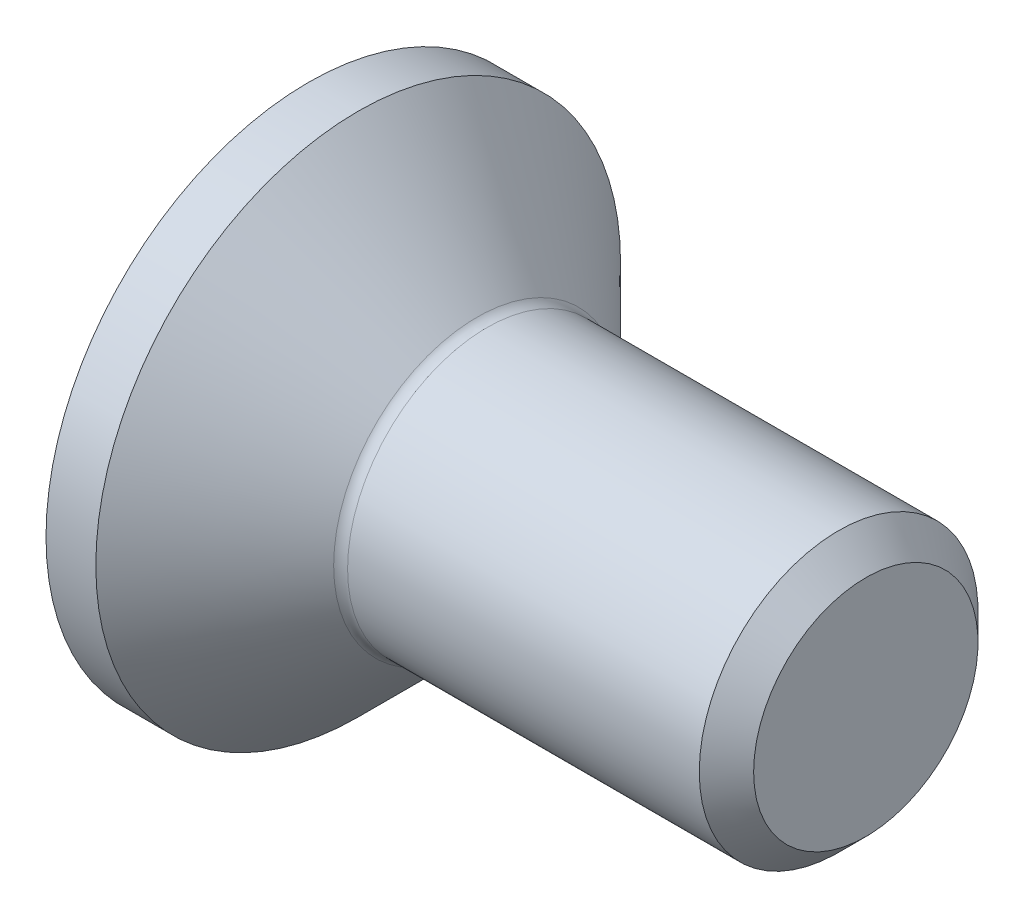
ISO-10303-21;
HEADER;
FILE_DESCRIPTION(('STEP AP214'),'2;1');
FILE_NAME('part.step','',(''),(''),'','','');
FILE_SCHEMA(('AUTOMOTIVE_DESIGN { 1 0 10303 214 1 1 1 1 }'));
ENDSEC;
DATA;
#1=APPLICATION_CONTEXT('core data for automotive mechanical design processes');
#2=APPLICATION_PROTOCOL_DEFINITION('international standard','automotive_design',2000,#1);
#3=PRODUCT_CONTEXT('',#1,'mechanical');
#4=PRODUCT('Part','Part','',(#3));
#5=PRODUCT_RELATED_PRODUCT_CATEGORY('part','',(#4));
#6=PRODUCT_DEFINITION_FORMATION('','',#4);
#7=PRODUCT_DEFINITION_CONTEXT('part definition',#1,'design');
#8=PRODUCT_DEFINITION('design','',#6,#7);
#9=PRODUCT_DEFINITION_SHAPE('','',#8);
#10=(LENGTH_UNIT() NAMED_UNIT(*) SI_UNIT(.MILLI.,.METRE.));
#11=(NAMED_UNIT(*) PLANE_ANGLE_UNIT() SI_UNIT($,.RADIAN.));
#12=(NAMED_UNIT(*) SI_UNIT($,.STERADIAN.) SOLID_ANGLE_UNIT());
#13=UNCERTAINTY_MEASURE_WITH_UNIT(LENGTH_MEASURE(1.E-05),#10,'distance_accuracy_value','');
#14=(GEOMETRIC_REPRESENTATION_CONTEXT(3) GLOBAL_UNCERTAINTY_ASSIGNED_CONTEXT((#13)) GLOBAL_UNIT_ASSIGNED_CONTEXT((#10,
#11,#12)) REPRESENTATION_CONTEXT('',''));
#15=CARTESIAN_POINT('',(0.,0.,0.));
#16=DIRECTION('',(0.,0.,1.));
#17=DIRECTION('',(1.,0.,0.));
#18=AXIS2_PLACEMENT_3D('',#15,#16,#17);
#19=CARTESIAN_POINT('',(7.99999999999999,1.61,0.));
#20=DIRECTION('',(1.,0.,0.));
#21=DIRECTION('',(0.,0.,-1.));
#22=AXIS2_PLACEMENT_3D('',#19,#20,#21);
#23=PLANE('',#22);
#24=CARTESIAN_POINT('',(7.99999999998136,0.,0.));
#25=DIRECTION('',(-1.,0.,0.));
#26=DIRECTION('',(0.,0.,1.));
#27=AXIS2_PLACEMENT_3D('',#24,#25,#26);
#28=CIRCLE('',#27,1.61000000002787);
#29=CARTESIAN_POINT('',(7.99999999998136,0.,1.61000000002787));
#30=VERTEX_POINT('',#29);
#31=EDGE_CURVE('E20',#30,#30,#28,.T.);
#32=ORIENTED_EDGE('',*,*,#31,.F.);
#33=EDGE_LOOP('',(#32));
#34=FACE_BOUND('',#33,.T.);
#35=ADVANCED_FACE('F17',(#34),#23,.T.);
#36=CARTESIAN_POINT('',(7.60999999999967,0.,0.));
#37=DIRECTION('',(-1.,0.,0.));
#38=DIRECTION('',(0.,0.,1.));
#39=AXIS2_PLACEMENT_3D('',#36,#37,#38);
#40=CONICAL_SURFACE('',#39,2.00000000006639,0.785398163470325);
#41=ORIENTED_EDGE('',*,*,#31,.T.);
#42=EDGE_LOOP('',(#41));
#43=FACE_BOUND('',#42,.T.);
#44=CARTESIAN_POINT('',(7.60999999999999,0.,0.));
#45=DIRECTION('',(-1.,0.,0.));
#46=DIRECTION('',(0.,0.,1.));
#47=AXIS2_PLACEMENT_3D('',#44,#45,#46);
#48=CIRCLE('',#47,2.);
#49=CARTESIAN_POINT('',(7.60999999999999,0.,2.));
#50=VERTEX_POINT('',#49);
#51=EDGE_CURVE('E309',#50,#50,#48,.T.);
#52=ORIENTED_EDGE('',*,*,#51,.F.);
#53=EDGE_LOOP('',(#52));
#54=FACE_BOUND('',#53,.T.);
#55=ADVANCED_FACE('F232',(#43,#54),#40,.T.);
#56=CARTESIAN_POINT('',(0.,0.,0.));
#57=DIRECTION('',(-1.,0.,0.));
#58=DIRECTION('',(0.,0.,1.));
#59=AXIS2_PLACEMENT_3D('',#56,#57,#58);
#60=CYLINDRICAL_SURFACE('',#59,2.);
#61=ORIENTED_EDGE('',*,*,#51,.T.);
#62=EDGE_LOOP('',(#61));
#63=FACE_BOUND('',#62,.T.);
#64=CARTESIAN_POINT('',(2.56284271247462,0.,0.));
#65=DIRECTION('',(-1.,0.,0.));
#66=DIRECTION('',(0.,0.,1.));
#67=AXIS2_PLACEMENT_3D('',#64,#65,#66);
#68=CIRCLE('',#67,2.);
#69=CARTESIAN_POINT('',(2.56284271247462,0.,2.));
#70=VERTEX_POINT('',#69);
#71=EDGE_CURVE('E219',#70,#70,#68,.F.);
#72=ORIENTED_EDGE('',*,*,#71,.T.);
#73=EDGE_LOOP('',(#72));
#74=FACE_BOUND('',#73,.T.);
#75=ADVANCED_FACE('F228',(#63,#74),#60,.T.);
#76=CARTESIAN_POINT('',(2.56284271247462,0.,0.));
#77=DIRECTION('',(-1.,0.,0.));
#78=DIRECTION('',(0.,0.,1.));
#79=AXIS2_PLACEMENT_3D('',#76,#77,#78);
#80=TOROIDAL_SURFACE('',#79,2.2,0.2);
#81=ORIENTED_EDGE('',*,*,#71,.F.);
#82=EDGE_LOOP('',(#81));
#83=FACE_BOUND('',#82,.T.);
#84=CARTESIAN_POINT('',(2.4214213562459,0.,0.));
#85=DIRECTION('',(-1.,0.,0.));
#86=DIRECTION('',(0.,0.,1.));
#87=AXIS2_PLACEMENT_3D('',#84,#85,#86);
#88=CIRCLE('',#87,2.05857864375503);
#89=CARTESIAN_POINT('',(2.4214213562459,0.,2.05857864375503));
#90=VERTEX_POINT('',#89);
#91=EDGE_CURVE('E98',#90,#90,#88,.T.);
#92=ORIENTED_EDGE('',*,*,#91,.F.);
#93=EDGE_LOOP('',(#92));
#94=FACE_BOUND('',#93,.T.);
#95=ADVANCED_FACE('F224',(#83,#94),#80,.F.);
#96=CARTESIAN_POINT('',(1.50000000007822,0.,0.));
#97=DIRECTION('',(-1.,0.,0.));
#98=DIRECTION('',(0.,0.,1.));
#99=AXIS2_PLACEMENT_3D('',#96,#97,#98);
#100=CONICAL_SURFACE('',#99,1.25000000002728,1.04719755116835);
#101=CARTESIAN_POINT('',(2.22168783656684,0.,-5.6843418860808E-11));
#102=VERTEX_POINT('',#101);
#103=VERTEX_LOOP('',#102);
#104=FACE_BOUND('',#103,.T.);
#105=CARTESIAN_POINT('',(1.50000000007822,0.,0.));
#106=DIRECTION('',(-1.,0.,0.));
#107=DIRECTION('',(0.,0.,1.));
#108=AXIS2_PLACEMENT_3D('',#105,#106,#107);
#109=CIRCLE('',#108,1.25000000002728);
#110=CARTESIAN_POINT('',(1.50000000003911,-1.31737871907351E-12,-1.25000000001364));
#111=VERTEX_POINT('',#110);
#112=CARTESIAN_POINT('',(1.50000000003911,1.08253175474236,-0.625000000006822));
#113=VERTEX_POINT('',#112);
#114=EDGE_CURVE('E315',#111,#113,#109,.F.);
#115=ORIENTED_EDGE('',*,*,#114,.F.);
#116=CARTESIAN_POINT('',(1.50000000007822,0.,0.));
#117=DIRECTION('',(-1.,0.,0.));
#118=DIRECTION('',(0.,0.,1.));
#119=AXIS2_PLACEMENT_3D('',#116,#117,#118);
#120=CIRCLE('',#119,1.25000000002728);
#121=CARTESIAN_POINT('',(1.50000000003911,-1.08253175474236,-0.625000000006822));
#122=VERTEX_POINT('',#121);
#123=EDGE_CURVE('E93',#122,#111,#120,.F.);
#124=ORIENTED_EDGE('',*,*,#123,.F.);
#125=CARTESIAN_POINT('',(1.50000000007822,0.,0.));
#126=DIRECTION('',(-1.,0.,0.));
#127=DIRECTION('',(0.,0.,1.));
#128=AXIS2_PLACEMENT_3D('',#125,#126,#127);
#129=CIRCLE('',#128,1.25000000002728);
#130=CARTESIAN_POINT('',(1.50000000003911,-1.08253175474236,0.625000000006822));
#131=VERTEX_POINT('',#130);
#132=EDGE_CURVE('E87',#131,#122,#129,.F.);
#133=ORIENTED_EDGE('',*,*,#132,.F.);
#134=CARTESIAN_POINT('',(1.50000000007822,0.,0.));
#135=DIRECTION('',(-1.,0.,0.));
#136=DIRECTION('',(0.,0.,1.));
#137=AXIS2_PLACEMENT_3D('',#134,#135,#136);
#138=CIRCLE('',#137,1.25000000002728);
#139=CARTESIAN_POINT('',(1.50000000003911,0.,1.25000000001364));
#140=VERTEX_POINT('',#139);
#141=EDGE_CURVE('E90',#140,#131,#138,.F.);
#142=ORIENTED_EDGE('',*,*,#141,.F.);
#143=CARTESIAN_POINT('',(1.50000000007822,0.,0.));
#144=DIRECTION('',(-1.,0.,0.));
#145=DIRECTION('',(0.,0.,1.));
#146=AXIS2_PLACEMENT_3D('',#143,#144,#145);
#147=CIRCLE('',#146,1.25000000002728);
#148=CARTESIAN_POINT('',(1.50000000003911,1.08253175474236,0.625000000006821));
#149=VERTEX_POINT('',#148);
#150=EDGE_CURVE('E109',#149,#140,#147,.F.);
#151=ORIENTED_EDGE('',*,*,#150,.F.);
#152=CARTESIAN_POINT('',(1.50000000007822,0.,0.));
#153=DIRECTION('',(-1.,0.,0.));
#154=DIRECTION('',(0.,0.,1.));
#155=AXIS2_PLACEMENT_3D('',#152,#153,#154);
#156=CIRCLE('',#155,1.25000000002728);
#157=EDGE_CURVE('E312',#113,#149,#156,.F.);
#158=ORIENTED_EDGE('',*,*,#157,.F.);
#159=EDGE_LOOP('',(#115,#124,#133,#142,#151,#158));
#160=FACE_BOUND('',#159,.T.);
#161=ADVANCED_FACE('F89',(#104,#160),#100,.F.);
#162=CARTESIAN_POINT('',(0.715000000070631,0.,0.));
#163=DIRECTION('',(-1.,0.,0.));
#164=DIRECTION('',(0.,0.,1.));
#165=AXIS2_PLACEMENT_3D('',#162,#163,#164);
#166=CONICAL_SURFACE('',#165,3.76499999987345,0.785398163380793);
#167=ORIENTED_EDGE('',*,*,#91,.T.);
#168=EDGE_LOOP('',(#167));
#169=FACE_BOUND('',#168,.T.);
#170=CARTESIAN_POINT('',(0.71500000000001,0.,0.));
#171=DIRECTION('',(-1.,0.,0.));
#172=DIRECTION('',(0.,0.,1.));
#173=AXIS2_PLACEMENT_3D('',#170,#171,#172);
#174=CIRCLE('',#173,3.765);
#175=CARTESIAN_POINT('',(0.71500000000001,0.,3.765));
#176=VERTEX_POINT('',#175);
#177=EDGE_CURVE('E108',#176,#176,#174,.T.);
#178=ORIENTED_EDGE('',*,*,#177,.F.);
#179=EDGE_LOOP('',(#178));
#180=FACE_BOUND('',#179,.T.);
#181=ADVANCED_FACE('F295',(#169,#180),#166,.T.);
#182=CARTESIAN_POINT('',(1.5,-1.44337567297407,0.));
#183=DIRECTION('',(-1.,0.,0.));
#184=DIRECTION('',(0.,0.,1.));
#185=AXIS2_PLACEMENT_3D('',#182,#183,#184);
#186=PLANE('',#185);
#187=DIRECTION('',(0.,-0.500000000000001,0.866025403784438));
#188=VECTOR('',#187,1.);
#189=CARTESIAN_POINT('',(1.5,-1.44337567297407,0.));
#190=LINE('',#189,#188);
#191=CARTESIAN_POINT('',(1.5,-1.44337567297407,0.));
#192=VERTEX_POINT('',#191);
#193=EDGE_CURVE('E114',#192,#122,#190,.F.);
#194=ORIENTED_EDGE('',*,*,#193,.F.);
#195=DIRECTION('',(0.,0.500000000000001,0.866025403784438));
#196=VECTOR('',#195,1.);
#197=CARTESIAN_POINT('',(1.5,-0.721687836487031,1.25));
#198=LINE('',#197,#196);
#199=EDGE_CURVE('E111',#131,#192,#198,.F.);
#200=ORIENTED_EDGE('',*,*,#199,.F.);
#201=ORIENTED_EDGE('',*,*,#132,.T.);
#202=EDGE_LOOP('',(#194,#200,#201));
#203=FACE_BOUND('',#202,.T.);
#204=ADVANCED_FACE('F112',(#203),#186,.T.);
#205=CARTESIAN_POINT('',(1.5,-1.44337567297407,0.));
#206=DIRECTION('',(-1.,0.,0.));
#207=DIRECTION('',(0.,0.,1.));
#208=AXIS2_PLACEMENT_3D('',#205,#206,#207);
#209=PLANE('',#208);
#210=DIRECTION('',(0.,-1.,0.));
#211=VECTOR('',#210,1.);
#212=CARTESIAN_POINT('',(1.5,-0.721687836487032,-1.25));
#213=LINE('',#212,#211);
#214=CARTESIAN_POINT('',(1.5,-0.721687836487032,-1.25));
#215=VERTEX_POINT('',#214);
#216=EDGE_CURVE('E178',#215,#111,#213,.F.);
#217=ORIENTED_EDGE('',*,*,#216,.F.);
#218=DIRECTION('',(0.,-0.500000000000001,0.866025403784438));
#219=VECTOR('',#218,1.);
#220=CARTESIAN_POINT('',(1.5,-1.44337567297407,0.));
#221=LINE('',#220,#219);
#222=EDGE_CURVE('E193',#122,#215,#221,.F.);
#223=ORIENTED_EDGE('',*,*,#222,.F.);
#224=ORIENTED_EDGE('',*,*,#123,.T.);
#225=EDGE_LOOP('',(#217,#223,#224));
#226=FACE_BOUND('',#225,.T.);
#227=ADVANCED_FACE('F289',(#226),#209,.T.);
#228=CARTESIAN_POINT('',(1.5,-1.44337567297407,0.));
#229=DIRECTION('',(-1.,0.,0.));
#230=DIRECTION('',(0.,0.,1.));
#231=AXIS2_PLACEMENT_3D('',#228,#229,#230);
#232=PLANE('',#231);
#233=DIRECTION('',(0.,-0.500000000000001,-0.866025403784438));
#234=VECTOR('',#233,1.);
#235=CARTESIAN_POINT('',(1.5,0.721687836487033,-1.25));
#236=LINE('',#235,#234);
#237=CARTESIAN_POINT('',(1.5,0.721687836487033,-1.25));
#238=VERTEX_POINT('',#237);
#239=EDGE_CURVE('E159',#238,#113,#236,.F.);
#240=ORIENTED_EDGE('',*,*,#239,.F.);
#241=DIRECTION('',(0.,-1.,0.));
#242=VECTOR('',#241,1.);
#243=CARTESIAN_POINT('',(1.5,-0.721687836487032,-1.25));
#244=LINE('',#243,#242);
#245=EDGE_CURVE('E174',#111,#238,#244,.F.);
#246=ORIENTED_EDGE('',*,*,#245,.F.);
#247=ORIENTED_EDGE('',*,*,#114,.T.);
#248=EDGE_LOOP('',(#240,#246,#247));
#249=FACE_BOUND('',#248,.T.);
#250=ADVANCED_FACE('F285',(#249),#232,.T.);
#251=CARTESIAN_POINT('',(1.5,-1.44337567297407,0.));
#252=DIRECTION('',(-1.,0.,0.));
#253=DIRECTION('',(0.,0.,1.));
#254=AXIS2_PLACEMENT_3D('',#251,#252,#253);
#255=PLANE('',#254);
#256=DIRECTION('',(0.,0.5,-0.866025403784439));
#257=VECTOR('',#256,1.);
#258=CARTESIAN_POINT('',(1.5,1.44337567297407,0.));
#259=LINE('',#258,#257);
#260=CARTESIAN_POINT('',(1.5,1.44337567297407,0.));
#261=VERTEX_POINT('',#260);
#262=EDGE_CURVE('E138',#261,#149,#259,.F.);
#263=ORIENTED_EDGE('',*,*,#262,.F.);
#264=DIRECTION('',(0.,-0.500000000000001,-0.866025403784438));
#265=VECTOR('',#264,1.);
#266=CARTESIAN_POINT('',(1.5,0.721687836487033,-1.25));
#267=LINE('',#266,#265);
#268=EDGE_CURVE('E155',#113,#261,#267,.F.);
#269=ORIENTED_EDGE('',*,*,#268,.F.);
#270=ORIENTED_EDGE('',*,*,#157,.T.);
#271=EDGE_LOOP('',(#263,#269,#270));
#272=FACE_BOUND('',#271,.T.);
#273=ADVANCED_FACE('F281',(#272),#255,.T.);
#274=CARTESIAN_POINT('',(1.5,-1.44337567297407,0.));
#275=DIRECTION('',(-1.,0.,0.));
#276=DIRECTION('',(0.,0.,1.));
#277=AXIS2_PLACEMENT_3D('',#274,#275,#276);
#278=PLANE('',#277);
#279=DIRECTION('',(0.,1.,0.));
#280=VECTOR('',#279,1.);
#281=CARTESIAN_POINT('',(1.5,0.721687836487033,1.25));
#282=LINE('',#281,#280);
#283=CARTESIAN_POINT('',(1.5,0.721687836487033,1.25));
#284=VERTEX_POINT('',#283);
#285=EDGE_CURVE('E133',#284,#140,#282,.F.);
#286=ORIENTED_EDGE('',*,*,#285,.F.);
#287=DIRECTION('',(0.,0.5,-0.866025403784439));
#288=VECTOR('',#287,1.);
#289=CARTESIAN_POINT('',(1.5,1.44337567297407,0.));
#290=LINE('',#289,#288);
#291=EDGE_CURVE('E134',#149,#284,#290,.F.);
#292=ORIENTED_EDGE('',*,*,#291,.F.);
#293=ORIENTED_EDGE('',*,*,#150,.T.);
#294=EDGE_LOOP('',(#286,#292,#293));
#295=FACE_BOUND('',#294,.T.);
#296=ADVANCED_FACE('F278',(#295),#278,.T.);
#297=CARTESIAN_POINT('',(1.5,-1.44337567297407,0.));
#298=DIRECTION('',(-1.,0.,0.));
#299=DIRECTION('',(0.,0.,1.));
#300=AXIS2_PLACEMENT_3D('',#297,#298,#299);
#301=PLANE('',#300);
#302=DIRECTION('',(0.,0.500000000000001,0.866025403784438));
#303=VECTOR('',#302,1.);
#304=CARTESIAN_POINT('',(1.5,-0.721687836487031,1.25));
#305=LINE('',#304,#303);
#306=CARTESIAN_POINT('',(1.5,-0.721687836487031,1.25));
#307=VERTEX_POINT('',#306);
#308=EDGE_CURVE('E103',#307,#131,#305,.F.);
#309=ORIENTED_EDGE('',*,*,#308,.F.);
#310=DIRECTION('',(0.,1.,0.));
#311=VECTOR('',#310,1.);
#312=CARTESIAN_POINT('',(1.5,0.721687836487033,1.25));
#313=LINE('',#312,#311);
#314=EDGE_CURVE('E106',#140,#307,#313,.F.);
#315=ORIENTED_EDGE('',*,*,#314,.F.);
#316=ORIENTED_EDGE('',*,*,#141,.T.);
#317=EDGE_LOOP('',(#309,#315,#316));
#318=FACE_BOUND('',#317,.T.);
#319=ADVANCED_FACE('F101',(#318),#301,.T.);
#320=CARTESIAN_POINT('',(0.,0.,0.));
#321=DIRECTION('',(-1.,0.,0.));
#322=DIRECTION('',(0.,0.,1.));
#323=AXIS2_PLACEMENT_3D('',#320,#321,#322);
#324=CYLINDRICAL_SURFACE('',#323,3.765);
#325=ORIENTED_EDGE('',*,*,#177,.T.);
#326=EDGE_LOOP('',(#325));
#327=FACE_BOUND('',#326,.T.);
#328=CARTESIAN_POINT('',(0.,0.,0.));
#329=DIRECTION('',(-1.,0.,0.));
#330=DIRECTION('',(0.,0.,1.));
#331=AXIS2_PLACEMENT_3D('',#328,#329,#330);
#332=CIRCLE('',#331,3.765);
#333=CARTESIAN_POINT('',(0.,0.,3.765));
#334=VERTEX_POINT('',#333);
#335=EDGE_CURVE('E214',#334,#334,#332,.T.);
#336=ORIENTED_EDGE('',*,*,#335,.F.);
#337=EDGE_LOOP('',(#336));
#338=FACE_BOUND('',#337,.T.);
#339=ADVANCED_FACE('F272',(#327,#338),#324,.T.);
#340=CARTESIAN_POINT('',(1.5,-0.721687836487031,1.25));
#341=DIRECTION('',(0.,0.866025403784438,-0.500000000000001));
#342=DIRECTION('',(0.,0.500000000000001,0.866025403784438));
#343=AXIS2_PLACEMENT_3D('',#340,#341,#342);
#344=PLANE('',#343);
#345=ORIENTED_EDGE('',*,*,#199,.T.);
#346=DIRECTION('',(1.,0.,0.));
#347=VECTOR('',#346,1.);
#348=CARTESIAN_POINT('',(1.5,-1.44337567297407,0.));
#349=LINE('',#348,#347);
#350=CARTESIAN_POINT('',(0.,-1.44337567297407,0.));
#351=VERTEX_POINT('',#350);
#352=EDGE_CURVE('E117',#351,#192,#349,.T.);
#353=ORIENTED_EDGE('',*,*,#352,.F.);
#354=DIRECTION('',(0.,-0.500000000000001,-0.866025403784438));
#355=VECTOR('',#354,1.);
#356=CARTESIAN_POINT('',(0.,-0.721687836487031,1.25));
#357=LINE('',#356,#355);
#358=CARTESIAN_POINT('',(0.,-0.721687836487031,1.25));
#359=VERTEX_POINT('',#358);
#360=EDGE_CURVE('E201',#359,#351,#357,.T.);
#361=ORIENTED_EDGE('',*,*,#360,.F.);
#362=DIRECTION('',(1.,0.,0.));
#363=VECTOR('',#362,1.);
#364=CARTESIAN_POINT('',(1.5,-0.721687836487031,1.25));
#365=LINE('',#364,#363);
#366=EDGE_CURVE('E122',#307,#359,#365,.F.);
#367=ORIENTED_EDGE('',*,*,#366,.F.);
#368=ORIENTED_EDGE('',*,*,#308,.T.);
#369=EDGE_LOOP('',(#345,#353,#361,#367,#368));
#370=FACE_BOUND('',#369,.T.);
#371=ADVANCED_FACE('F119',(#370),#344,.T.);
#372=CARTESIAN_POINT('',(1.5,-1.44337567297407,0.));
#373=DIRECTION('',(0.,0.866025403784438,0.500000000000001));
#374=DIRECTION('',(0.,-0.500000000000001,0.866025403784438));
#375=AXIS2_PLACEMENT_3D('',#372,#373,#374);
#376=PLANE('',#375);
#377=ORIENTED_EDGE('',*,*,#222,.T.);
#378=DIRECTION('',(1.,0.,0.));
#379=VECTOR('',#378,1.);
#380=CARTESIAN_POINT('',(1.5,-0.721687836487032,-1.25));
#381=LINE('',#380,#379);
#382=CARTESIAN_POINT('',(0.,-0.721687836487032,-1.25));
#383=VERTEX_POINT('',#382);
#384=EDGE_CURVE('E188',#383,#215,#381,.T.);
#385=ORIENTED_EDGE('',*,*,#384,.F.);
#386=DIRECTION('',(0.,0.500000000000001,-0.866025403784438));
#387=VECTOR('',#386,1.);
#388=CARTESIAN_POINT('',(0.,-1.44337567297407,0.));
#389=LINE('',#388,#387);
#390=EDGE_CURVE('E183',#351,#383,#389,.T.);
#391=ORIENTED_EDGE('',*,*,#390,.F.);
#392=ORIENTED_EDGE('',*,*,#352,.T.);
#393=ORIENTED_EDGE('',*,*,#193,.T.);
#394=EDGE_LOOP('',(#377,#385,#391,#392,#393));
#395=FACE_BOUND('',#394,.T.);
#396=ADVANCED_FACE('F265',(#395),#376,.T.);
#397=CARTESIAN_POINT('',(1.5,-0.721687836487032,-1.25));
#398=DIRECTION('',(0.,0.,1.));
#399=DIRECTION('',(0.,-1.,0.));
#400=AXIS2_PLACEMENT_3D('',#397,#398,#399);
#401=PLANE('',#400);
#402=ORIENTED_EDGE('',*,*,#245,.T.);
#403=DIRECTION('',(1.,0.,0.));
#404=VECTOR('',#403,1.);
#405=CARTESIAN_POINT('',(1.5,0.721687836487033,-1.25));
#406=LINE('',#405,#404);
#407=CARTESIAN_POINT('',(0.,0.721687836487033,-1.25));
#408=VERTEX_POINT('',#407);
#409=EDGE_CURVE('E169',#408,#238,#406,.T.);
#410=ORIENTED_EDGE('',*,*,#409,.F.);
#411=DIRECTION('',(0.,1.,0.));
#412=VECTOR('',#411,1.);
#413=CARTESIAN_POINT('',(0.,0.,-1.25));
#414=LINE('',#413,#412);
#415=EDGE_CURVE('E164',#383,#408,#414,.T.);
#416=ORIENTED_EDGE('',*,*,#415,.F.);
#417=ORIENTED_EDGE('',*,*,#384,.T.);
#418=ORIENTED_EDGE('',*,*,#216,.T.);
#419=EDGE_LOOP('',(#402,#410,#416,#417,#418));
#420=FACE_BOUND('',#419,.T.);
#421=ADVANCED_FACE('F261',(#420),#401,.T.);
#422=CARTESIAN_POINT('',(1.5,0.721687836487033,-1.25));
#423=DIRECTION('',(0.,-0.866025403784438,0.500000000000001));
#424=DIRECTION('',(0.,-0.500000000000001,-0.866025403784438));
#425=AXIS2_PLACEMENT_3D('',#422,#423,#424);
#426=PLANE('',#425);
#427=ORIENTED_EDGE('',*,*,#268,.T.);
#428=DIRECTION('',(1.,0.,0.));
#429=VECTOR('',#428,1.);
#430=CARTESIAN_POINT('',(1.5,1.44337567297407,0.));
#431=LINE('',#430,#429);
#432=CARTESIAN_POINT('',(0.,1.44337567297407,0.));
#433=VERTEX_POINT('',#432);
#434=EDGE_CURVE('E150',#433,#261,#431,.T.);
#435=ORIENTED_EDGE('',*,*,#434,.F.);
#436=DIRECTION('',(0.,0.500000000000001,0.866025403784438));
#437=VECTOR('',#436,1.);
#438=CARTESIAN_POINT('',(0.,0.721687836487033,-1.25));
#439=LINE('',#438,#437);
#440=EDGE_CURVE('E145',#408,#433,#439,.T.);
#441=ORIENTED_EDGE('',*,*,#440,.F.);
#442=ORIENTED_EDGE('',*,*,#409,.T.);
#443=ORIENTED_EDGE('',*,*,#239,.T.);
#444=EDGE_LOOP('',(#427,#435,#441,#442,#443));
#445=FACE_BOUND('',#444,.T.);
#446=ADVANCED_FACE('F258',(#445),#426,.T.);
#447=CARTESIAN_POINT('',(1.5,1.44337567297407,0.));
#448=DIRECTION('',(0.,-0.866025403784439,-0.5));
#449=DIRECTION('',(0.,0.5,-0.866025403784439));
#450=AXIS2_PLACEMENT_3D('',#447,#448,#449);
#451=PLANE('',#450);
#452=ORIENTED_EDGE('',*,*,#291,.T.);
#453=DIRECTION('',(1.,0.,0.));
#454=VECTOR('',#453,1.);
#455=CARTESIAN_POINT('',(1.5,0.721687836487033,1.25));
#456=LINE('',#455,#454);
#457=CARTESIAN_POINT('',(0.,0.721687836487033,1.25));
#458=VERTEX_POINT('',#457);
#459=EDGE_CURVE('E35',#458,#284,#456,.T.);
#460=ORIENTED_EDGE('',*,*,#459,.F.);
#461=DIRECTION('',(0.,-0.5,0.866025403784438));
#462=VECTOR('',#461,1.);
#463=CARTESIAN_POINT('',(0.,1.44337567297407,0.));
#464=LINE('',#463,#462);
#465=EDGE_CURVE('E26',#433,#458,#464,.T.);
#466=ORIENTED_EDGE('',*,*,#465,.F.);
#467=ORIENTED_EDGE('',*,*,#434,.T.);
#468=ORIENTED_EDGE('',*,*,#262,.T.);
#469=EDGE_LOOP('',(#452,#460,#466,#467,#468));
#470=FACE_BOUND('',#469,.T.);
#471=ADVANCED_FACE('F251',(#470),#451,.T.);
#472=CARTESIAN_POINT('',(1.5,0.721687836487033,1.25));
#473=DIRECTION('',(0.,0.,-1.));
#474=DIRECTION('',(0.,1.,0.));
#475=AXIS2_PLACEMENT_3D('',#472,#473,#474);
#476=PLANE('',#475);
#477=ORIENTED_EDGE('',*,*,#314,.T.);
#478=ORIENTED_EDGE('',*,*,#366,.T.);
#479=DIRECTION('',(0.,1.,0.));
#480=VECTOR('',#479,1.);
#481=CARTESIAN_POINT('',(0.,0.,1.25));
#482=LINE('',#481,#480);
#483=EDGE_CURVE('E11',#458,#359,#482,.F.);
#484=ORIENTED_EDGE('',*,*,#483,.F.);
#485=ORIENTED_EDGE('',*,*,#459,.T.);
#486=ORIENTED_EDGE('',*,*,#285,.T.);
#487=EDGE_LOOP('',(#477,#478,#484,#485,#486));
#488=FACE_BOUND('',#487,.T.);
#489=ADVANCED_FACE('F245',(#488),#476,.T.);
#490=CARTESIAN_POINT('',(0.,0.,0.));
#491=DIRECTION('',(-1.,0.,0.));
#492=DIRECTION('',(0.,0.,1.));
#493=AXIS2_PLACEMENT_3D('',#490,#491,#492);
#494=PLANE('',#493);
#495=ORIENTED_EDGE('',*,*,#465,.T.);
#496=ORIENTED_EDGE('',*,*,#483,.T.);
#497=ORIENTED_EDGE('',*,*,#360,.T.);
#498=ORIENTED_EDGE('',*,*,#390,.T.);
#499=ORIENTED_EDGE('',*,*,#415,.T.);
#500=ORIENTED_EDGE('',*,*,#440,.T.);
#501=EDGE_LOOP('',(#495,#496,#497,#498,#499,#500));
#502=FACE_BOUND('',#501,.T.);
#503=ORIENTED_EDGE('',*,*,#335,.T.);
#504=EDGE_LOOP('',(#503));
#505=FACE_BOUND('',#504,.T.);
#506=ADVANCED_FACE('F243',(#502,#505),#494,.T.);
#507=CLOSED_SHELL('',(#35,#55,#75,#95,#161,#181,#204,#227,#250,#273,#296,#319,#339,#371,#396,
#421,#446,#471,#489,#506));
#508=MANIFOLD_SOLID_BREP('B1',#507);
#509=ADVANCED_BREP_SHAPE_REPRESENTATION('',(#18,#508),#14);
#510=SHAPE_DEFINITION_REPRESENTATION(#9,#509);
ENDSEC;
END-ISO-10303-21;
